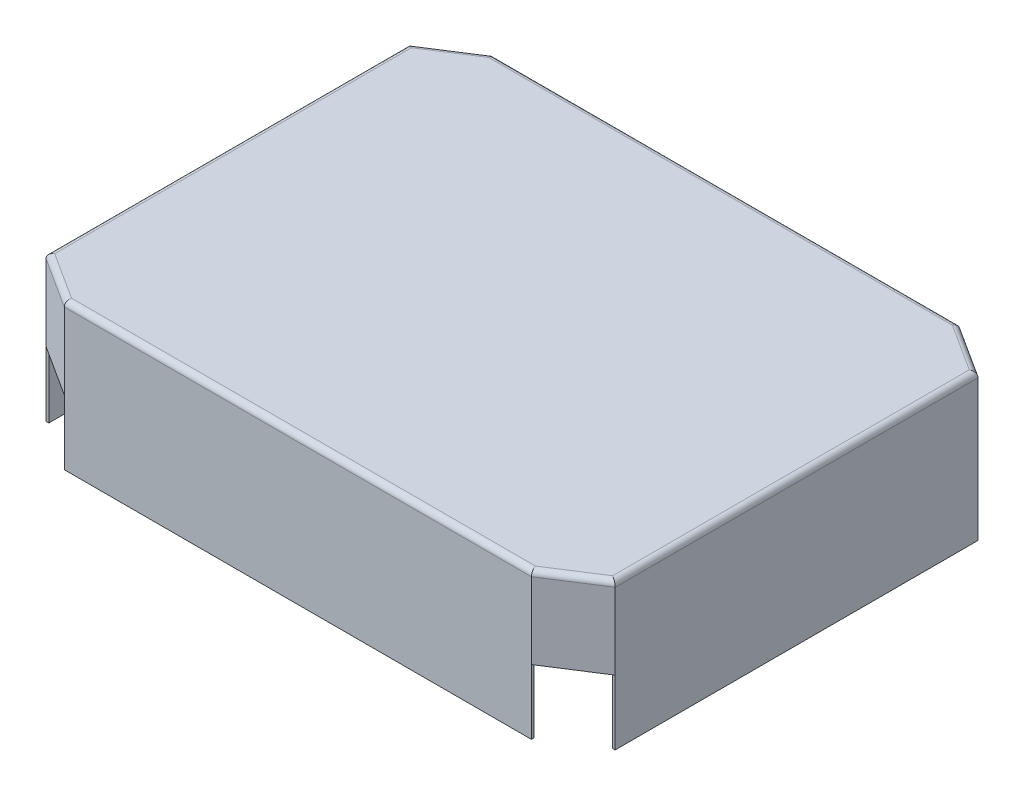
ISO-10303-21;
HEADER;
FILE_DESCRIPTION(('STEP AP214'),'2;1');
FILE_NAME('part.step','',(''),(''),'','','');
FILE_SCHEMA(('AUTOMOTIVE_DESIGN { 1 0 10303 214 1 1 1 1 }'));
ENDSEC;
DATA;
#1=APPLICATION_CONTEXT('core data for automotive mechanical design processes');
#2=APPLICATION_PROTOCOL_DEFINITION('international standard','automotive_design',2000,#1);
#3=PRODUCT_CONTEXT('',#1,'mechanical');
#4=PRODUCT('Part','Part','',(#3));
#5=PRODUCT_RELATED_PRODUCT_CATEGORY('part','',(#4));
#6=PRODUCT_DEFINITION_FORMATION('','',#4);
#7=PRODUCT_DEFINITION_CONTEXT('part definition',#1,'design');
#8=PRODUCT_DEFINITION('design','',#6,#7);
#9=PRODUCT_DEFINITION_SHAPE('','',#8);
#10=(LENGTH_UNIT() NAMED_UNIT(*) SI_UNIT(.MILLI.,.METRE.));
#11=(NAMED_UNIT(*) PLANE_ANGLE_UNIT() SI_UNIT($,.RADIAN.));
#12=(NAMED_UNIT(*) SI_UNIT($,.STERADIAN.) SOLID_ANGLE_UNIT());
#13=UNCERTAINTY_MEASURE_WITH_UNIT(LENGTH_MEASURE(1.E-05),#10,'distance_accuracy_value','');
#14=(GEOMETRIC_REPRESENTATION_CONTEXT(3) GLOBAL_UNCERTAINTY_ASSIGNED_CONTEXT((#13)) GLOBAL_UNIT_ASSIGNED_CONTEXT((#10,
#11,#12)) REPRESENTATION_CONTEXT('',''));
#15=CARTESIAN_POINT('',(0.,0.,0.));
#16=DIRECTION('',(0.,0.,1.));
#17=DIRECTION('',(1.,0.,0.));
#18=AXIS2_PLACEMENT_3D('',#15,#16,#17);
#19=CARTESIAN_POINT('',(0.,29.21,0.));
#20=DIRECTION('',(0.,-1.,0.));
#21=DIRECTION('',(0.,0.,-1.));
#22=AXIS2_PLACEMENT_3D('',#19,#20,#21);
#23=PLANE('',#22);
#24=DIRECTION('',(0.84985072279373,0.,-0.527023480470248));
#25=VECTOR('',#24,1.);
#26=CARTESIAN_POINT('',(127.,29.21,81.7796180000001));
#27=LINE('',#26,#25);
#28=CARTESIAN_POINT('',(105.278360825986,29.21,95.25));
#29=VERTEX_POINT('',#28);
#30=CARTESIAN_POINT('',(127.,29.21,81.7796180000001));
#31=VERTEX_POINT('',#30);
#32=EDGE_CURVE('E249',#29,#31,#27,.T.);
#33=ORIENTED_EDGE('',*,*,#32,.T.);
#34=DIRECTION('',(1.,0.,0.));
#35=VECTOR('',#34,1.);
#36=CARTESIAN_POINT('',(0.,29.21,81.7796180000001));
#37=LINE('',#36,#35);
#38=CARTESIAN_POINT('',(128.27,29.21,81.7796180000001));
#39=VERTEX_POINT('',#38);
#40=EDGE_CURVE('E393',#31,#39,#37,.T.);
#41=ORIENTED_EDGE('',*,*,#40,.T.);
#42=DIRECTION('',(0.841843341472549,0.,-0.539721954730705));
#43=VECTOR('',#42,1.);
#44=CARTESIAN_POINT('',(128.27,29.21,81.7796180000001));
#45=LINE('',#44,#43);
#46=CARTESIAN_POINT('',(105.278360825986,29.21,96.52));
#47=VERTEX_POINT('',#46);
#48=EDGE_CURVE('E274',#47,#39,#45,.T.);
#49=ORIENTED_EDGE('',*,*,#48,.F.);
#50=DIRECTION('',(0.,0.,1.));
#51=VECTOR('',#50,1.);
#52=CARTESIAN_POINT('',(105.278360825986,29.21,0.));
#53=LINE('',#52,#51);
#54=EDGE_CURVE('E303',#29,#47,#53,.T.);
#55=ORIENTED_EDGE('',*,*,#54,.F.);
#56=EDGE_LOOP('',(#33,#41,#49,#55));
#57=FACE_BOUND('',#56,.T.);
#58=ADVANCED_FACE('F32',(#57),#23,.T.);
#59=DIRECTION('',(1.,0.,0.));
#60=VECTOR('',#59,1.);
#61=CARTESIAN_POINT('',(-1.78727588284739E-12,29.21,-81.7796179999973));
#62=LINE('',#61,#60);
#63=CARTESIAN_POINT('',(127.,29.21,-81.7796180000001));
#64=VERTEX_POINT('',#63);
#65=CARTESIAN_POINT('',(128.27,29.21,-81.7796180000001));
#66=VERTEX_POINT('',#65);
#67=EDGE_CURVE('E401',#64,#66,#62,.T.);
#68=ORIENTED_EDGE('',*,*,#67,.F.);
#69=DIRECTION('',(-0.84985072279373,0.,-0.527023480470248));
#70=VECTOR('',#69,1.);
#71=CARTESIAN_POINT('',(105.278360825986,29.21,-95.25));
#72=LINE('',#71,#70);
#73=CARTESIAN_POINT('',(105.278360825986,29.21,-95.25));
#74=VERTEX_POINT('',#73);
#75=EDGE_CURVE('E253',#64,#74,#72,.T.);
#76=ORIENTED_EDGE('',*,*,#75,.T.);
#77=DIRECTION('',(0.,0.,-1.));
#78=VECTOR('',#77,1.);
#79=CARTESIAN_POINT('',(105.278360825986,29.21,0.));
#80=LINE('',#79,#78);
#81=CARTESIAN_POINT('',(105.278360825986,29.21,-96.52));
#82=VERTEX_POINT('',#81);
#83=EDGE_CURVE('E411',#74,#82,#80,.T.);
#84=ORIENTED_EDGE('',*,*,#83,.T.);
#85=DIRECTION('',(-0.841843341472549,0.,-0.539721954730705));
#86=VECTOR('',#85,1.);
#87=CARTESIAN_POINT('',(105.278360825986,29.21,-96.52));
#88=LINE('',#87,#86);
#89=EDGE_CURVE('E277',#66,#82,#88,.T.);
#90=ORIENTED_EDGE('',*,*,#89,.F.);
#91=EDGE_LOOP('',(#68,#76,#84,#90));
#92=FACE_BOUND('',#91,.T.);
#93=ADVANCED_FACE('F483',(#92),#23,.T.);
#94=DIRECTION('',(0.,0.,-1.));
#95=VECTOR('',#94,1.);
#96=CARTESIAN_POINT('',(-105.278360825986,29.21,0.));
#97=LINE('',#96,#95);
#98=CARTESIAN_POINT('',(-105.278360825986,29.21,-95.25));
#99=VERTEX_POINT('',#98);
#100=CARTESIAN_POINT('',(-105.278360825986,29.21,-96.52));
#101=VERTEX_POINT('',#100);
#102=EDGE_CURVE('E414',#99,#101,#97,.T.);
#103=ORIENTED_EDGE('',*,*,#102,.F.);
#104=DIRECTION('',(-0.84985072279373,0.,0.527023480470249));
#105=VECTOR('',#104,1.);
#106=CARTESIAN_POINT('',(-127.,29.21,-81.7796180000001));
#107=LINE('',#106,#105);
#108=CARTESIAN_POINT('',(-127.,29.21,-81.779618));
#109=VERTEX_POINT('',#108);
#110=EDGE_CURVE('E232',#99,#109,#107,.T.);
#111=ORIENTED_EDGE('',*,*,#110,.T.);
#112=DIRECTION('',(-1.,0.,0.));
#113=VECTOR('',#112,1.);
#114=CARTESIAN_POINT('',(0.,29.21,-81.7796180000001));
#115=LINE('',#114,#113);
#116=CARTESIAN_POINT('',(-128.27,29.21,-81.7796180000001));
#117=VERTEX_POINT('',#116);
#118=EDGE_CURVE('E438',#109,#117,#115,.T.);
#119=ORIENTED_EDGE('',*,*,#118,.T.);
#120=DIRECTION('',(-0.841843341472549,0.,0.539721954730706));
#121=VECTOR('',#120,1.);
#122=CARTESIAN_POINT('',(-128.27,29.21,-81.7796180000001));
#123=LINE('',#122,#121);
#124=EDGE_CURVE('E280',#101,#117,#123,.T.);
#125=ORIENTED_EDGE('',*,*,#124,.F.);
#126=EDGE_LOOP('',(#103,#111,#119,#125));
#127=FACE_BOUND('',#126,.T.);
#128=ADVANCED_FACE('F577',(#127),#23,.T.);
#129=CARTESIAN_POINT('',(0.,29.21,95.25));
#130=DIRECTION('',(0.,0.,-1.));
#131=DIRECTION('',(-1.,0.,0.));
#132=AXIS2_PLACEMENT_3D('',#129,#130,#131);
#133=PLANE('',#132);
#134=DIRECTION('',(1.,0.,0.));
#135=VECTOR('',#134,1.);
#136=CARTESIAN_POINT('',(0.,0.,95.25));
#137=LINE('',#136,#135);
#138=CARTESIAN_POINT('',(-105.278360825986,0.,95.25));
#139=VERTEX_POINT('',#138);
#140=CARTESIAN_POINT('',(105.278360825986,0.,95.25));
#141=VERTEX_POINT('',#140);
#142=EDGE_CURVE('E299',#139,#141,#137,.T.);
#143=ORIENTED_EDGE('',*,*,#142,.F.);
#144=DIRECTION('',(0.,-1.,0.));
#145=VECTOR('',#144,1.);
#146=CARTESIAN_POINT('',(-105.278360825986,29.21,95.25));
#147=LINE('',#146,#145);
#148=CARTESIAN_POINT('',(-105.278360825986,29.21,95.25));
#149=VERTEX_POINT('',#148);
#150=EDGE_CURVE('E323',#149,#139,#147,.T.);
#151=ORIENTED_EDGE('',*,*,#150,.F.);
#152=DIRECTION('',(0.,-1.,0.));
#153=VECTOR('',#152,1.);
#154=CARTESIAN_POINT('',(-105.278360825986,64.77,95.25));
#155=LINE('',#154,#153);
#156=CARTESIAN_POINT('',(-105.278360825986,64.77,95.25));
#157=VERTEX_POINT('',#156);
#158=EDGE_CURVE('E267',#157,#149,#155,.T.);
#159=ORIENTED_EDGE('',*,*,#158,.F.);
#160=DIRECTION('',(1.,0.,0.));
#161=VECTOR('',#160,1.);
#162=CARTESIAN_POINT('',(105.278360825986,64.77,95.25));
#163=LINE('',#162,#161);
#164=CARTESIAN_POINT('',(105.278360825986,64.77,95.25));
#165=VERTEX_POINT('',#164);
#166=EDGE_CURVE('E467',#157,#165,#163,.T.);
#167=ORIENTED_EDGE('',*,*,#166,.T.);
#168=DIRECTION('',(0.,-1.,0.));
#169=VECTOR('',#168,1.);
#170=CARTESIAN_POINT('',(105.278360825986,64.77,95.25));
#171=LINE('',#170,#169);
#172=EDGE_CURVE('E264',#165,#29,#171,.T.);
#173=ORIENTED_EDGE('',*,*,#172,.T.);
#174=DIRECTION('',(0.,-1.,0.));
#175=VECTOR('',#174,1.);
#176=CARTESIAN_POINT('',(105.278360825986,29.21,95.25));
#177=LINE('',#176,#175);
#178=EDGE_CURVE('E307',#29,#141,#177,.T.);
#179=ORIENTED_EDGE('',*,*,#178,.T.);
#180=EDGE_LOOP('',(#143,#151,#159,#167,#173,#179));
#181=FACE_BOUND('',#180,.T.);
#182=ADVANCED_FACE('F541',(#181),#133,.T.);
#183=CARTESIAN_POINT('',(-105.278360825986,29.21,0.));
#184=DIRECTION('',(1.,0.,0.));
#185=DIRECTION('',(0.,0.,-1.));
#186=AXIS2_PLACEMENT_3D('',#183,#184,#185);
#187=PLANE('',#186);
#188=DIRECTION('',(0.,0.,1.));
#189=VECTOR('',#188,1.);
#190=CARTESIAN_POINT('',(-105.278360825986,0.,0.));
#191=LINE('',#190,#189);
#192=CARTESIAN_POINT('',(-105.278360825986,0.,96.52));
#193=VERTEX_POINT('',#192);
#194=EDGE_CURVE('E310',#139,#193,#191,.T.);
#195=ORIENTED_EDGE('',*,*,#194,.T.);
#196=DIRECTION('',(0.,-1.,0.));
#197=VECTOR('',#196,1.);
#198=CARTESIAN_POINT('',(-105.278360825986,29.21,96.52));
#199=LINE('',#198,#197);
#200=CARTESIAN_POINT('',(-105.278360825986,29.21,96.52));
#201=VERTEX_POINT('',#200);
#202=EDGE_CURVE('E321',#201,#193,#199,.T.);
#203=ORIENTED_EDGE('',*,*,#202,.F.);
#204=DIRECTION('',(0.,0.,1.));
#205=VECTOR('',#204,1.);
#206=CARTESIAN_POINT('',(-105.278360825986,29.21,0.));
#207=LINE('',#206,#205);
#208=EDGE_CURVE('E300',#149,#201,#207,.T.);
#209=ORIENTED_EDGE('',*,*,#208,.F.);
#210=ORIENTED_EDGE('',*,*,#150,.T.);
#211=EDGE_LOOP('',(#195,#203,#209,#210));
#212=FACE_BOUND('',#211,.T.);
#213=ADVANCED_FACE('F549',(#212),#187,.F.);
#214=CARTESIAN_POINT('',(0.,29.21,96.52));
#215=DIRECTION('',(0.,0.,1.));
#216=DIRECTION('',(1.,0.,0.));
#217=AXIS2_PLACEMENT_3D('',#214,#215,#216);
#218=PLANE('',#217);
#219=DIRECTION('',(0.,-1.,0.));
#220=VECTOR('',#219,1.);
#221=CARTESIAN_POINT('',(105.278360825986,64.77,96.52));
#222=LINE('',#221,#220);
#223=CARTESIAN_POINT('',(105.278360825986,63.5,96.52));
#224=VERTEX_POINT('',#223);
#225=EDGE_CURVE('E293',#224,#47,#222,.T.);
#226=ORIENTED_EDGE('',*,*,#225,.F.);
#227=DIRECTION('',(1.,0.,0.));
#228=VECTOR('',#227,1.);
#229=CARTESIAN_POINT('',(-105.278360825986,63.5,96.52));
#230=LINE('',#229,#228);
#231=CARTESIAN_POINT('',(-105.278360825986,63.5,96.52));
#232=VERTEX_POINT('',#231);
#233=EDGE_CURVE('E345',#224,#232,#230,.F.);
#234=ORIENTED_EDGE('',*,*,#233,.T.);
#235=DIRECTION('',(0.,-1.,0.));
#236=VECTOR('',#235,1.);
#237=CARTESIAN_POINT('',(-105.278360825986,64.77,96.52));
#238=LINE('',#237,#236);
#239=EDGE_CURVE('E295',#232,#201,#238,.T.);
#240=ORIENTED_EDGE('',*,*,#239,.T.);
#241=ORIENTED_EDGE('',*,*,#202,.T.);
#242=DIRECTION('',(-1.,0.,0.));
#243=VECTOR('',#242,1.);
#244=CARTESIAN_POINT('',(0.,0.,96.52));
#245=LINE('',#244,#243);
#246=CARTESIAN_POINT('',(105.278360825986,0.,96.52));
#247=VERTEX_POINT('',#246);
#248=EDGE_CURVE('E313',#247,#193,#245,.T.);
#249=ORIENTED_EDGE('',*,*,#248,.F.);
#250=DIRECTION('',(0.,-1.,0.));
#251=VECTOR('',#250,1.);
#252=CARTESIAN_POINT('',(105.278360825986,29.21,96.52));
#253=LINE('',#252,#251);
#254=EDGE_CURVE('E319',#47,#247,#253,.T.);
#255=ORIENTED_EDGE('',*,*,#254,.F.);
#256=EDGE_LOOP('',(#226,#234,#240,#241,#249,#255));
#257=FACE_BOUND('',#256,.T.);
#258=ADVANCED_FACE('F601',(#257),#218,.T.);
#259=CARTESIAN_POINT('',(105.278360825986,29.21,0.));
#260=DIRECTION('',(1.,0.,0.));
#261=DIRECTION('',(0.,0.,-1.));
#262=AXIS2_PLACEMENT_3D('',#259,#260,#261);
#263=PLANE('',#262);
#264=DIRECTION('',(0.,0.,1.));
#265=VECTOR('',#264,1.);
#266=CARTESIAN_POINT('',(105.278360825986,0.,0.));
#267=LINE('',#266,#265);
#268=EDGE_CURVE('E304',#141,#247,#267,.T.);
#269=ORIENTED_EDGE('',*,*,#268,.F.);
#270=ORIENTED_EDGE('',*,*,#178,.F.);
#271=ORIENTED_EDGE('',*,*,#54,.T.);
#272=ORIENTED_EDGE('',*,*,#254,.T.);
#273=EDGE_LOOP('',(#269,#270,#271,#272));
#274=FACE_BOUND('',#273,.T.);
#275=ADVANCED_FACE('F538',(#274),#263,.T.);
#276=CARTESIAN_POINT('',(0.,0.,0.));
#277=DIRECTION('',(0.,1.,0.));
#278=DIRECTION('',(0.,0.,1.));
#279=AXIS2_PLACEMENT_3D('',#276,#277,#278);
#280=PLANE('',#279);
#281=ORIENTED_EDGE('',*,*,#142,.T.);
#282=ORIENTED_EDGE('',*,*,#268,.T.);
#283=ORIENTED_EDGE('',*,*,#248,.T.);
#284=ORIENTED_EDGE('',*,*,#194,.F.);
#285=EDGE_LOOP('',(#281,#282,#283,#284));
#286=FACE_BOUND('',#285,.T.);
#287=ADVANCED_FACE('F545',(#286),#280,.F.);
#288=DIRECTION('',(-1.,0.,0.));
#289=VECTOR('',#288,1.);
#290=CARTESIAN_POINT('',(1.78727588284743E-12,29.21,81.7796179999973));
#291=LINE('',#290,#289);
#292=CARTESIAN_POINT('',(-127.,29.21,81.7796180000001));
#293=VERTEX_POINT('',#292);
#294=CARTESIAN_POINT('',(-128.27,29.21,81.7796180000001));
#295=VERTEX_POINT('',#294);
#296=EDGE_CURVE('E441',#293,#295,#291,.T.);
#297=ORIENTED_EDGE('',*,*,#296,.F.);
#298=DIRECTION('',(0.84985072279373,0.,0.527023480470249));
#299=VECTOR('',#298,1.);
#300=CARTESIAN_POINT('',(-105.278360825986,29.21,95.25));
#301=LINE('',#300,#299);
#302=EDGE_CURVE('E246',#293,#149,#301,.T.);
#303=ORIENTED_EDGE('',*,*,#302,.T.);
#304=ORIENTED_EDGE('',*,*,#208,.T.);
#305=DIRECTION('',(0.841843341472549,0.,0.539721954730705));
#306=VECTOR('',#305,1.);
#307=CARTESIAN_POINT('',(-105.278360825986,29.21,96.52));
#308=LINE('',#307,#306);
#309=EDGE_CURVE('E271',#295,#201,#308,.T.);
#310=ORIENTED_EDGE('',*,*,#309,.F.);
#311=EDGE_LOOP('',(#297,#303,#304,#310));
#312=FACE_BOUND('',#311,.T.);
#313=ADVANCED_FACE('F558',(#312),#23,.T.);
#314=CARTESIAN_POINT('',(-128.27,64.77,81.7796180000001));
#315=DIRECTION('',(1.,0.,0.));
#316=DIRECTION('',(0.,0.,-1.));
#317=AXIS2_PLACEMENT_3D('',#314,#315,#316);
#318=PLANE('',#317);
#319=DIRECTION('',(0.,-1.,0.));
#320=VECTOR('',#319,1.);
#321=CARTESIAN_POINT('',(-128.27,64.77,81.7796180000001));
#322=LINE('',#321,#320);
#323=CARTESIAN_POINT('',(-128.27,63.5,81.7796180000001));
#324=VERTEX_POINT('',#323);
#325=EDGE_CURVE('E297',#324,#295,#322,.T.);
#326=ORIENTED_EDGE('',*,*,#325,.F.);
#327=DIRECTION('',(0.,0.,1.));
#328=VECTOR('',#327,1.);
#329=CARTESIAN_POINT('',(-128.27,63.5,81.7796180000001));
#330=LINE('',#329,#328);
#331=CARTESIAN_POINT('',(-128.27,63.5,-81.7796180000001));
#332=VERTEX_POINT('',#331);
#333=EDGE_CURVE('E41',#324,#332,#330,.F.);
#334=ORIENTED_EDGE('',*,*,#333,.T.);
#335=DIRECTION('',(0.,-1.,0.));
#336=VECTOR('',#335,1.);
#337=CARTESIAN_POINT('',(-128.27,64.77,-81.7796180000001));
#338=LINE('',#337,#336);
#339=EDGE_CURVE('E283',#332,#117,#338,.T.);
#340=ORIENTED_EDGE('',*,*,#339,.T.);
#341=DIRECTION('',(0.,-1.,0.));
#342=VECTOR('',#341,1.);
#343=CARTESIAN_POINT('',(-128.27,29.21,-81.7796180000001));
#344=LINE('',#343,#342);
#345=CARTESIAN_POINT('',(-128.27,0.,-81.7796180000001));
#346=VERTEX_POINT('',#345);
#347=EDGE_CURVE('E250',#117,#346,#344,.T.);
#348=ORIENTED_EDGE('',*,*,#347,.T.);
#349=DIRECTION('',(0.,0.,1.));
#350=VECTOR('',#349,1.);
#351=CARTESIAN_POINT('',(-128.27,0.,0.));
#352=LINE('',#351,#350);
#353=CARTESIAN_POINT('',(-128.27,0.,81.7796180000001));
#354=VERTEX_POINT('',#353);
#355=EDGE_CURVE('E448',#346,#354,#352,.T.);
#356=ORIENTED_EDGE('',*,*,#355,.T.);
#357=DIRECTION('',(0.,-1.,0.));
#358=VECTOR('',#357,1.);
#359=CARTESIAN_POINT('',(-128.27,29.21,81.7796180000001));
#360=LINE('',#359,#358);
#361=EDGE_CURVE('E459',#295,#354,#360,.T.);
#362=ORIENTED_EDGE('',*,*,#361,.F.);
#363=EDGE_LOOP('',(#326,#334,#340,#348,#356,#362));
#364=FACE_BOUND('',#363,.T.);
#365=ADVANCED_FACE('F626',(#364),#318,.F.);
#366=CARTESIAN_POINT('',(-105.278360825986,64.77,96.52));
#367=DIRECTION('',(0.539721954730705,0.,-0.841843341472549));
#368=DIRECTION('',(-0.841843341472549,0.,-0.539721954730705));
#369=AXIS2_PLACEMENT_3D('',#366,#367,#368);
#370=PLANE('',#369);
#371=ORIENTED_EDGE('',*,*,#239,.F.);
#372=DIRECTION('',(0.841843341472549,0.,0.539721954730705));
#373=VECTOR('',#372,1.);
#374=CARTESIAN_POINT('',(-105.278360825986,63.5,96.52));
#375=LINE('',#374,#373);
#376=EDGE_CURVE('E342',#232,#324,#375,.F.);
#377=ORIENTED_EDGE('',*,*,#376,.T.);
#378=ORIENTED_EDGE('',*,*,#325,.T.);
#379=ORIENTED_EDGE('',*,*,#309,.T.);
#380=EDGE_LOOP('',(#371,#377,#378,#379));
#381=FACE_BOUND('',#380,.T.);
#382=ADVANCED_FACE('F604',(#381),#370,.F.);
#383=CARTESIAN_POINT('',(128.27,64.77,81.7796180000001));
#384=DIRECTION('',(-0.539721954730705,0.,-0.841843341472549));
#385=DIRECTION('',(-0.841843341472549,0.,0.539721954730705));
#386=AXIS2_PLACEMENT_3D('',#383,#384,#385);
#387=PLANE('',#386);
#388=DIRECTION('',(0.,-1.,0.));
#389=VECTOR('',#388,1.);
#390=CARTESIAN_POINT('',(128.27,64.77,81.7796180000001));
#391=LINE('',#390,#389);
#392=CARTESIAN_POINT('',(128.27,63.5,81.7796180000001));
#393=VERTEX_POINT('',#392);
#394=EDGE_CURVE('E291',#393,#39,#391,.T.);
#395=ORIENTED_EDGE('',*,*,#394,.F.);
#396=DIRECTION('',(0.841843341472549,0.,-0.539721954730705));
#397=VECTOR('',#396,1.);
#398=CARTESIAN_POINT('',(128.27,63.5,81.7796180000001));
#399=LINE('',#398,#397);
#400=EDGE_CURVE('E347',#393,#224,#399,.F.);
#401=ORIENTED_EDGE('',*,*,#400,.T.);
#402=ORIENTED_EDGE('',*,*,#225,.T.);
#403=ORIENTED_EDGE('',*,*,#48,.T.);
#404=EDGE_LOOP('',(#395,#401,#402,#403));
#405=FACE_BOUND('',#404,.T.);
#406=ADVANCED_FACE('F517',(#405),#387,.F.);
#407=CARTESIAN_POINT('',(128.27,64.77,-81.7796180000001));
#408=DIRECTION('',(-1.,0.,0.));
#409=DIRECTION('',(0.,0.,1.));
#410=AXIS2_PLACEMENT_3D('',#407,#408,#409);
#411=PLANE('',#410);
#412=DIRECTION('',(0.,-1.,0.));
#413=VECTOR('',#412,1.);
#414=CARTESIAN_POINT('',(128.27,64.77,-81.7796180000001));
#415=LINE('',#414,#413);
#416=CARTESIAN_POINT('',(128.27,63.5,-81.7796180000001));
#417=VERTEX_POINT('',#416);
#418=EDGE_CURVE('E289',#417,#66,#415,.T.);
#419=ORIENTED_EDGE('',*,*,#418,.F.);
#420=DIRECTION('',(0.,0.,-1.));
#421=VECTOR('',#420,1.);
#422=CARTESIAN_POINT('',(128.27,63.5,-81.7796180000001));
#423=LINE('',#422,#421);
#424=EDGE_CURVE('E349',#417,#393,#423,.F.);
#425=ORIENTED_EDGE('',*,*,#424,.T.);
#426=ORIENTED_EDGE('',*,*,#394,.T.);
#427=DIRECTION('',(0.,-1.,0.));
#428=VECTOR('',#427,1.);
#429=CARTESIAN_POINT('',(128.27,29.21,81.7796180000001));
#430=LINE('',#429,#428);
#431=CARTESIAN_POINT('',(128.27,0.,81.7796180000001));
#432=VERTEX_POINT('',#431);
#433=EDGE_CURVE('E402',#39,#432,#430,.T.);
#434=ORIENTED_EDGE('',*,*,#433,.T.);
#435=DIRECTION('',(0.,0.,1.));
#436=VECTOR('',#435,1.);
#437=CARTESIAN_POINT('',(128.27,0.,0.));
#438=LINE('',#437,#436);
#439=CARTESIAN_POINT('',(128.27,0.,-81.7796180000001));
#440=VERTEX_POINT('',#439);
#441=EDGE_CURVE('E378',#440,#432,#438,.T.);
#442=ORIENTED_EDGE('',*,*,#441,.F.);
#443=DIRECTION('',(0.,-1.,0.));
#444=VECTOR('',#443,1.);
#445=CARTESIAN_POINT('',(128.27,29.21,-81.7796180000001));
#446=LINE('',#445,#444);
#447=EDGE_CURVE('E408',#66,#440,#446,.T.);
#448=ORIENTED_EDGE('',*,*,#447,.F.);
#449=EDGE_LOOP('',(#419,#425,#426,#434,#442,#448));
#450=FACE_BOUND('',#449,.T.);
#451=ADVANCED_FACE('F513',(#450),#411,.F.);
#452=CARTESIAN_POINT('',(105.278360825986,64.77,-96.52));
#453=DIRECTION('',(-0.539721954730705,0.,0.841843341472549));
#454=DIRECTION('',(0.841843341472549,0.,0.539721954730705));
#455=AXIS2_PLACEMENT_3D('',#452,#453,#454);
#456=PLANE('',#455);
#457=DIRECTION('',(0.,-1.,0.));
#458=VECTOR('',#457,1.);
#459=CARTESIAN_POINT('',(105.278360825986,64.77,-96.52));
#460=LINE('',#459,#458);
#461=CARTESIAN_POINT('',(105.278360825986,63.5,-96.52));
#462=VERTEX_POINT('',#461);
#463=EDGE_CURVE('E287',#462,#82,#460,.T.);
#464=ORIENTED_EDGE('',*,*,#463,.F.);
#465=DIRECTION('',(-0.841843341472549,0.,-0.539721954730705));
#466=VECTOR('',#465,1.);
#467=CARTESIAN_POINT('',(105.278360825986,63.5,-96.52));
#468=LINE('',#467,#466);
#469=EDGE_CURVE('E351',#462,#417,#468,.F.);
#470=ORIENTED_EDGE('',*,*,#469,.T.);
#471=ORIENTED_EDGE('',*,*,#418,.T.);
#472=ORIENTED_EDGE('',*,*,#89,.T.);
#473=EDGE_LOOP('',(#464,#470,#471,#472));
#474=FACE_BOUND('',#473,.T.);
#475=ADVANCED_FACE('F504',(#474),#456,.F.);
#476=CARTESIAN_POINT('',(-105.278360825986,64.77,-96.52));
#477=DIRECTION('',(0.,0.,1.));
#478=DIRECTION('',(1.,0.,0.));
#479=AXIS2_PLACEMENT_3D('',#476,#477,#478);
#480=PLANE('',#479);
#481=DIRECTION('',(0.,-1.,0.));
#482=VECTOR('',#481,1.);
#483=CARTESIAN_POINT('',(-105.278360825986,64.77,-96.52));
#484=LINE('',#483,#482);
#485=CARTESIAN_POINT('',(-105.278360825986,63.5,-96.52));
#486=VERTEX_POINT('',#485);
#487=EDGE_CURVE('E285',#486,#101,#484,.T.);
#488=ORIENTED_EDGE('',*,*,#487,.F.);
#489=DIRECTION('',(-1.,0.,0.));
#490=VECTOR('',#489,1.);
#491=CARTESIAN_POINT('',(-105.278360825986,63.5,-96.52));
#492=LINE('',#491,#490);
#493=EDGE_CURVE('E353',#486,#462,#492,.F.);
#494=ORIENTED_EDGE('',*,*,#493,.T.);
#495=ORIENTED_EDGE('',*,*,#463,.T.);
#496=DIRECTION('',(0.,-1.,0.));
#497=VECTOR('',#496,1.);
#498=CARTESIAN_POINT('',(105.278360825986,29.21,-96.52));
#499=LINE('',#498,#497);
#500=CARTESIAN_POINT('',(105.278360825986,0.,-96.52));
#501=VERTEX_POINT('',#500);
#502=EDGE_CURVE('E432',#82,#501,#499,.T.);
#503=ORIENTED_EDGE('',*,*,#502,.T.);
#504=DIRECTION('',(1.,0.,0.));
#505=VECTOR('',#504,1.);
#506=CARTESIAN_POINT('',(0.,0.,-96.52));
#507=LINE('',#506,#505);
#508=CARTESIAN_POINT('',(-105.278360825986,0.,-96.52));
#509=VERTEX_POINT('',#508);
#510=EDGE_CURVE('E424',#509,#501,#507,.T.);
#511=ORIENTED_EDGE('',*,*,#510,.F.);
#512=DIRECTION('',(0.,-1.,0.));
#513=VECTOR('',#512,1.);
#514=CARTESIAN_POINT('',(-105.278360825986,29.21,-96.52));
#515=LINE('',#514,#513);
#516=EDGE_CURVE('E430',#101,#509,#515,.T.);
#517=ORIENTED_EDGE('',*,*,#516,.F.);
#518=EDGE_LOOP('',(#488,#494,#495,#503,#511,#517));
#519=FACE_BOUND('',#518,.T.);
#520=ADVANCED_FACE('F500',(#519),#480,.F.);
#521=CARTESIAN_POINT('',(-128.27,64.77,-81.7796180000001));
#522=DIRECTION('',(0.539721954730706,0.,0.841843341472549));
#523=DIRECTION('',(0.841843341472549,0.,-0.539721954730706));
#524=AXIS2_PLACEMENT_3D('',#521,#522,#523);
#525=PLANE('',#524);
#526=ORIENTED_EDGE('',*,*,#339,.F.);
#527=DIRECTION('',(-0.841843341472549,0.,0.539721954730706));
#528=VECTOR('',#527,1.);
#529=CARTESIAN_POINT('',(-128.27,63.5,-81.7796180000001));
#530=LINE('',#529,#528);
#531=EDGE_CURVE('E11',#332,#486,#530,.F.);
#532=ORIENTED_EDGE('',*,*,#531,.T.);
#533=ORIENTED_EDGE('',*,*,#487,.T.);
#534=ORIENTED_EDGE('',*,*,#124,.T.);
#535=EDGE_LOOP('',(#526,#532,#533,#534));
#536=FACE_BOUND('',#535,.T.);
#537=ADVANCED_FACE('F579',(#536),#525,.F.);
#538=CARTESIAN_POINT('',(-127.,64.77,81.7796180000001));
#539=DIRECTION('',(1.,0.,0.));
#540=DIRECTION('',(0.,0.,-1.));
#541=AXIS2_PLACEMENT_3D('',#538,#539,#540);
#542=PLANE('',#541);
#543=DIRECTION('',(0.,-1.,0.));
#544=VECTOR('',#543,1.);
#545=CARTESIAN_POINT('',(-127.,64.77,81.7796180000001));
#546=LINE('',#545,#544);
#547=CARTESIAN_POINT('',(-127.,64.77,81.7796180000001));
#548=VERTEX_POINT('',#547);
#549=EDGE_CURVE('E269',#548,#293,#546,.T.);
#550=ORIENTED_EDGE('',*,*,#549,.T.);
#551=DIRECTION('',(0.,-1.,0.));
#552=VECTOR('',#551,1.);
#553=CARTESIAN_POINT('',(-127.,29.21,81.7796180000001));
#554=LINE('',#553,#552);
#555=CARTESIAN_POINT('',(-127.,0.,81.7796180000001));
#556=VERTEX_POINT('',#555);
#557=EDGE_CURVE('E457',#293,#556,#554,.T.);
#558=ORIENTED_EDGE('',*,*,#557,.T.);
#559=DIRECTION('',(0.,0.,-1.));
#560=VECTOR('',#559,1.);
#561=CARTESIAN_POINT('',(-127.,0.,0.));
#562=LINE('',#561,#560);
#563=CARTESIAN_POINT('',(-127.,0.,-81.7796180000001));
#564=VERTEX_POINT('',#563);
#565=EDGE_CURVE('E442',#556,#564,#562,.T.);
#566=ORIENTED_EDGE('',*,*,#565,.T.);
#567=DIRECTION('',(0.,-1.,0.));
#568=VECTOR('',#567,1.);
#569=CARTESIAN_POINT('',(-127.,29.21,-81.7796180000001));
#570=LINE('',#569,#568);
#571=EDGE_CURVE('E445',#109,#564,#570,.T.);
#572=ORIENTED_EDGE('',*,*,#571,.F.);
#573=DIRECTION('',(0.,-1.,0.));
#574=VECTOR('',#573,1.);
#575=CARTESIAN_POINT('',(-127.,64.77,-81.7796180000001));
#576=LINE('',#575,#574);
#577=CARTESIAN_POINT('',(-127.,64.77,-81.7796180000001));
#578=VERTEX_POINT('',#577);
#579=EDGE_CURVE('E226',#578,#109,#576,.T.);
#580=ORIENTED_EDGE('',*,*,#579,.F.);
#581=DIRECTION('',(0.,0.,1.));
#582=VECTOR('',#581,1.);
#583=CARTESIAN_POINT('',(-127.,64.77,81.7796180000001));
#584=LINE('',#583,#582);
#585=EDGE_CURVE('E223',#578,#548,#584,.T.);
#586=ORIENTED_EDGE('',*,*,#585,.T.);
#587=EDGE_LOOP('',(#550,#558,#566,#572,#580,#586));
#588=FACE_BOUND('',#587,.T.);
#589=ADVANCED_FACE('F567',(#588),#542,.T.);
#590=CARTESIAN_POINT('',(-105.278360825986,64.77,95.25));
#591=DIRECTION('',(0.527023480470249,0.,-0.84985072279373));
#592=DIRECTION('',(-0.84985072279373,0.,-0.527023480470249));
#593=AXIS2_PLACEMENT_3D('',#590,#591,#592);
#594=PLANE('',#593);
#595=ORIENTED_EDGE('',*,*,#302,.F.);
#596=ORIENTED_EDGE('',*,*,#549,.F.);
#597=DIRECTION('',(0.84985072279373,0.,0.527023480470249));
#598=VECTOR('',#597,1.);
#599=CARTESIAN_POINT('',(-105.278360825986,64.77,95.25));
#600=LINE('',#599,#598);
#601=EDGE_CURVE('E464',#548,#157,#600,.T.);
#602=ORIENTED_EDGE('',*,*,#601,.T.);
#603=ORIENTED_EDGE('',*,*,#158,.T.);
#604=EDGE_LOOP('',(#595,#596,#602,#603));
#605=FACE_BOUND('',#604,.T.);
#606=ADVANCED_FACE('F554',(#605),#594,.T.);
#607=CARTESIAN_POINT('',(127.,64.77,81.7796180000001));
#608=DIRECTION('',(-0.527023480470248,0.,-0.849850722793731));
#609=DIRECTION('',(-0.84985072279373,0.,0.527023480470248));
#610=AXIS2_PLACEMENT_3D('',#607,#608,#609);
#611=PLANE('',#610);
#612=ORIENTED_EDGE('',*,*,#32,.F.);
#613=ORIENTED_EDGE('',*,*,#172,.F.);
#614=DIRECTION('',(0.84985072279373,0.,-0.527023480470248));
#615=VECTOR('',#614,1.);
#616=CARTESIAN_POINT('',(127.,64.77,81.7796180000001));
#617=LINE('',#616,#615);
#618=CARTESIAN_POINT('',(127.,64.77,81.7796180000001));
#619=VERTEX_POINT('',#618);
#620=EDGE_CURVE('E470',#165,#619,#617,.T.);
#621=ORIENTED_EDGE('',*,*,#620,.T.);
#622=DIRECTION('',(0.,-1.,0.));
#623=VECTOR('',#622,1.);
#624=CARTESIAN_POINT('',(127.,64.77,81.7796180000001));
#625=LINE('',#624,#623);
#626=EDGE_CURVE('E262',#619,#31,#625,.T.);
#627=ORIENTED_EDGE('',*,*,#626,.T.);
#628=EDGE_LOOP('',(#612,#613,#621,#627));
#629=FACE_BOUND('',#628,.T.);
#630=ADVANCED_FACE('F535',(#629),#611,.T.);
#631=CARTESIAN_POINT('',(127.,64.77,-81.7796180000001));
#632=DIRECTION('',(-1.,0.,0.));
#633=DIRECTION('',(0.,0.,1.));
#634=AXIS2_PLACEMENT_3D('',#631,#632,#633);
#635=PLANE('',#634);
#636=DIRECTION('',(0.,-1.,0.));
#637=VECTOR('',#636,1.);
#638=CARTESIAN_POINT('',(127.,64.77,-81.7796180000001));
#639=LINE('',#638,#637);
#640=CARTESIAN_POINT('',(127.,64.77,-81.7796180000001));
#641=VERTEX_POINT('',#640);
#642=EDGE_CURVE('E259',#641,#64,#639,.T.);
#643=ORIENTED_EDGE('',*,*,#642,.T.);
#644=DIRECTION('',(0.,-1.,0.));
#645=VECTOR('',#644,1.);
#646=CARTESIAN_POINT('',(127.,29.21,-81.7796180000001));
#647=LINE('',#646,#645);
#648=CARTESIAN_POINT('',(127.,0.,-81.7796180000001));
#649=VERTEX_POINT('',#648);
#650=EDGE_CURVE('E406',#64,#649,#647,.T.);
#651=ORIENTED_EDGE('',*,*,#650,.T.);
#652=DIRECTION('',(0.,0.,-1.));
#653=VECTOR('',#652,1.);
#654=CARTESIAN_POINT('',(127.,0.,0.));
#655=LINE('',#654,#653);
#656=CARTESIAN_POINT('',(127.,0.,81.7796180000001));
#657=VERTEX_POINT('',#656);
#658=EDGE_CURVE('E390',#657,#649,#655,.T.);
#659=ORIENTED_EDGE('',*,*,#658,.F.);
#660=DIRECTION('',(0.,-1.,0.));
#661=VECTOR('',#660,1.);
#662=CARTESIAN_POINT('',(127.,29.21,81.7796180000001));
#663=LINE('',#662,#661);
#664=EDGE_CURVE('E404',#31,#657,#663,.T.);
#665=ORIENTED_EDGE('',*,*,#664,.F.);
#666=ORIENTED_EDGE('',*,*,#626,.F.);
#667=DIRECTION('',(0.,0.,-1.));
#668=VECTOR('',#667,1.);
#669=CARTESIAN_POINT('',(127.,64.77,-81.7796180000001));
#670=LINE('',#669,#668);
#671=EDGE_CURVE('E242',#619,#641,#670,.T.);
#672=ORIENTED_EDGE('',*,*,#671,.T.);
#673=EDGE_LOOP('',(#643,#651,#659,#665,#666,#672));
#674=FACE_BOUND('',#673,.T.);
#675=ADVANCED_FACE('F476',(#674),#635,.T.);
#676=CARTESIAN_POINT('',(105.278360825986,64.77,-95.25));
#677=DIRECTION('',(-0.527023480470248,0.,0.849850722793731));
#678=DIRECTION('',(0.84985072279373,0.,0.527023480470248));
#679=AXIS2_PLACEMENT_3D('',#676,#677,#678);
#680=PLANE('',#679);
#681=ORIENTED_EDGE('',*,*,#75,.F.);
#682=ORIENTED_EDGE('',*,*,#642,.F.);
#683=DIRECTION('',(-0.84985072279373,0.,-0.527023480470248));
#684=VECTOR('',#683,1.);
#685=CARTESIAN_POINT('',(105.278360825986,64.77,-95.25));
#686=LINE('',#685,#684);
#687=CARTESIAN_POINT('',(105.278360825986,64.77,-95.25));
#688=VERTEX_POINT('',#687);
#689=EDGE_CURVE('E240',#641,#688,#686,.T.);
#690=ORIENTED_EDGE('',*,*,#689,.T.);
#691=DIRECTION('',(0.,-1.,0.));
#692=VECTOR('',#691,1.);
#693=CARTESIAN_POINT('',(105.278360825986,64.77,-95.25));
#694=LINE('',#693,#692);
#695=EDGE_CURVE('E235',#688,#74,#694,.T.);
#696=ORIENTED_EDGE('',*,*,#695,.T.);
#697=EDGE_LOOP('',(#681,#682,#690,#696));
#698=FACE_BOUND('',#697,.T.);
#699=ADVANCED_FACE('F480',(#698),#680,.T.);
#700=CARTESIAN_POINT('',(-105.278360825986,64.77,-95.25));
#701=DIRECTION('',(0.,0.,1.));
#702=DIRECTION('',(1.,0.,0.));
#703=AXIS2_PLACEMENT_3D('',#700,#701,#702);
#704=PLANE('',#703);
#705=DIRECTION('',(0.,-1.,0.));
#706=VECTOR('',#705,1.);
#707=CARTESIAN_POINT('',(-105.278360825986,64.77,-95.25));
#708=LINE('',#707,#706);
#709=CARTESIAN_POINT('',(-105.278360825986,64.77,-95.25));
#710=VERTEX_POINT('',#709);
#711=EDGE_CURVE('E229',#710,#99,#708,.T.);
#712=ORIENTED_EDGE('',*,*,#711,.T.);
#713=DIRECTION('',(0.,-1.,0.));
#714=VECTOR('',#713,1.);
#715=CARTESIAN_POINT('',(-105.278360825986,29.21,-95.25));
#716=LINE('',#715,#714);
#717=CARTESIAN_POINT('',(-105.278360825986,0.,-95.25));
#718=VERTEX_POINT('',#717);
#719=EDGE_CURVE('E418',#99,#718,#716,.T.);
#720=ORIENTED_EDGE('',*,*,#719,.T.);
#721=DIRECTION('',(1.,0.,0.));
#722=VECTOR('',#721,1.);
#723=CARTESIAN_POINT('',(0.,0.,-95.25));
#724=LINE('',#723,#722);
#725=CARTESIAN_POINT('',(105.278360825986,0.,-95.25));
#726=VERTEX_POINT('',#725);
#727=EDGE_CURVE('E410',#718,#726,#724,.T.);
#728=ORIENTED_EDGE('',*,*,#727,.T.);
#729=DIRECTION('',(0.,-1.,0.));
#730=VECTOR('',#729,1.);
#731=CARTESIAN_POINT('',(105.278360825986,29.21,-95.25));
#732=LINE('',#731,#730);
#733=EDGE_CURVE('E434',#74,#726,#732,.T.);
#734=ORIENTED_EDGE('',*,*,#733,.F.);
#735=ORIENTED_EDGE('',*,*,#695,.F.);
#736=DIRECTION('',(-1.,0.,0.));
#737=VECTOR('',#736,1.);
#738=CARTESIAN_POINT('',(-105.278360825986,64.77,-95.25));
#739=LINE('',#738,#737);
#740=EDGE_CURVE('E220',#688,#710,#739,.T.);
#741=ORIENTED_EDGE('',*,*,#740,.T.);
#742=EDGE_LOOP('',(#712,#720,#728,#734,#735,#741));
#743=FACE_BOUND('',#742,.T.);
#744=ADVANCED_FACE('F238',(#743),#704,.T.);
#745=CARTESIAN_POINT('',(-127.,64.77,-81.7796180000001));
#746=DIRECTION('',(0.527023480470249,0.,0.84985072279373));
#747=DIRECTION('',(0.84985072279373,0.,-0.527023480470249));
#748=AXIS2_PLACEMENT_3D('',#745,#746,#747);
#749=PLANE('',#748);
#750=ORIENTED_EDGE('',*,*,#110,.F.);
#751=ORIENTED_EDGE('',*,*,#711,.F.);
#752=DIRECTION('',(-0.84985072279373,0.,0.527023480470249));
#753=VECTOR('',#752,1.);
#754=CARTESIAN_POINT('',(-127.,64.77,-81.7796180000001));
#755=LINE('',#754,#753);
#756=EDGE_CURVE('E216',#710,#578,#755,.T.);
#757=ORIENTED_EDGE('',*,*,#756,.T.);
#758=ORIENTED_EDGE('',*,*,#579,.T.);
#759=EDGE_LOOP('',(#750,#751,#757,#758));
#760=FACE_BOUND('',#759,.T.);
#761=ADVANCED_FACE('F230',(#760),#749,.T.);
#762=CARTESIAN_POINT('',(0.,29.21,-81.7796180000001));
#763=DIRECTION('',(0.,0.,1.));
#764=DIRECTION('',(1.,0.,0.));
#765=AXIS2_PLACEMENT_3D('',#762,#763,#764);
#766=PLANE('',#765);
#767=DIRECTION('',(-1.,0.,0.));
#768=VECTOR('',#767,1.);
#769=CARTESIAN_POINT('',(0.,0.,-81.7796180000001));
#770=LINE('',#769,#768);
#771=EDGE_CURVE('E437',#564,#346,#770,.T.);
#772=ORIENTED_EDGE('',*,*,#771,.T.);
#773=ORIENTED_EDGE('',*,*,#347,.F.);
#774=ORIENTED_EDGE('',*,*,#118,.F.);
#775=ORIENTED_EDGE('',*,*,#571,.T.);
#776=EDGE_LOOP('',(#772,#773,#774,#775));
#777=FACE_BOUND('',#776,.T.);
#778=ADVANCED_FACE('F574',(#777),#766,.F.);
#779=CARTESIAN_POINT('',(1.78727588284743E-12,29.21,81.7796179999973));
#780=DIRECTION('',(0.,0.,1.));
#781=DIRECTION('',(1.,0.,0.));
#782=AXIS2_PLACEMENT_3D('',#779,#780,#781);
#783=PLANE('',#782);
#784=DIRECTION('',(-1.,0.,0.));
#785=VECTOR('',#784,1.);
#786=CARTESIAN_POINT('',(1.78727588284743E-12,0.,81.7796179999973));
#787=LINE('',#786,#785);
#788=EDGE_CURVE('E451',#556,#354,#787,.T.);
#789=ORIENTED_EDGE('',*,*,#788,.F.);
#790=ORIENTED_EDGE('',*,*,#557,.F.);
#791=ORIENTED_EDGE('',*,*,#296,.T.);
#792=ORIENTED_EDGE('',*,*,#361,.T.);
#793=EDGE_LOOP('',(#789,#790,#791,#792));
#794=FACE_BOUND('',#793,.T.);
#795=ADVANCED_FACE('F564',(#794),#783,.T.);
#796=CARTESIAN_POINT('',(0.,0.,0.));
#797=DIRECTION('',(0.,1.,0.));
#798=DIRECTION('',(0.,0.,1.));
#799=AXIS2_PLACEMENT_3D('',#796,#797,#798);
#800=PLANE('',#799);
#801=ORIENTED_EDGE('',*,*,#771,.F.);
#802=ORIENTED_EDGE('',*,*,#565,.F.);
#803=ORIENTED_EDGE('',*,*,#788,.T.);
#804=ORIENTED_EDGE('',*,*,#355,.F.);
#805=EDGE_LOOP('',(#801,#802,#803,#804));
#806=FACE_BOUND('',#805,.T.);
#807=ADVANCED_FACE('F571',(#806),#800,.F.);
#808=CARTESIAN_POINT('',(105.278360825986,29.21,0.));
#809=DIRECTION('',(-1.,0.,0.));
#810=DIRECTION('',(0.,0.,1.));
#811=AXIS2_PLACEMENT_3D('',#808,#809,#810);
#812=PLANE('',#811);
#813=DIRECTION('',(0.,0.,-1.));
#814=VECTOR('',#813,1.);
#815=CARTESIAN_POINT('',(105.278360825986,0.,0.));
#816=LINE('',#815,#814);
#817=EDGE_CURVE('E421',#726,#501,#816,.T.);
#818=ORIENTED_EDGE('',*,*,#817,.T.);
#819=ORIENTED_EDGE('',*,*,#502,.F.);
#820=ORIENTED_EDGE('',*,*,#83,.F.);
#821=ORIENTED_EDGE('',*,*,#733,.T.);
#822=EDGE_LOOP('',(#818,#819,#820,#821));
#823=FACE_BOUND('',#822,.T.);
#824=ADVANCED_FACE('F489',(#823),#812,.F.);
#825=CARTESIAN_POINT('',(-105.278360825986,29.21,0.));
#826=DIRECTION('',(-1.,0.,0.));
#827=DIRECTION('',(0.,0.,1.));
#828=AXIS2_PLACEMENT_3D('',#825,#826,#827);
#829=PLANE('',#828);
#830=DIRECTION('',(0.,0.,-1.));
#831=VECTOR('',#830,1.);
#832=CARTESIAN_POINT('',(-105.278360825986,0.,0.));
#833=LINE('',#832,#831);
#834=EDGE_CURVE('E415',#718,#509,#833,.T.);
#835=ORIENTED_EDGE('',*,*,#834,.F.);
#836=ORIENTED_EDGE('',*,*,#719,.F.);
#837=ORIENTED_EDGE('',*,*,#102,.T.);
#838=ORIENTED_EDGE('',*,*,#516,.T.);
#839=EDGE_LOOP('',(#835,#836,#837,#838));
#840=FACE_BOUND('',#839,.T.);
#841=ADVANCED_FACE('F496',(#840),#829,.T.);
#842=CARTESIAN_POINT('',(0.,0.,0.));
#843=DIRECTION('',(0.,1.,0.));
#844=DIRECTION('',(0.,0.,1.));
#845=AXIS2_PLACEMENT_3D('',#842,#843,#844);
#846=PLANE('',#845);
#847=ORIENTED_EDGE('',*,*,#727,.F.);
#848=ORIENTED_EDGE('',*,*,#834,.T.);
#849=ORIENTED_EDGE('',*,*,#510,.T.);
#850=ORIENTED_EDGE('',*,*,#817,.F.);
#851=EDGE_LOOP('',(#847,#848,#849,#850));
#852=FACE_BOUND('',#851,.T.);
#853=ADVANCED_FACE('F494',(#852),#846,.F.);
#854=CARTESIAN_POINT('',(-1.78727588284739E-12,29.21,-81.7796179999973));
#855=DIRECTION('',(0.,0.,-1.));
#856=DIRECTION('',(-1.,0.,0.));
#857=AXIS2_PLACEMENT_3D('',#854,#855,#856);
#858=PLANE('',#857);
#859=DIRECTION('',(1.,0.,0.));
#860=VECTOR('',#859,1.);
#861=CARTESIAN_POINT('',(-1.78727588284739E-12,0.,-81.7796179999973));
#862=LINE('',#861,#860);
#863=EDGE_CURVE('E384',#649,#440,#862,.T.);
#864=ORIENTED_EDGE('',*,*,#863,.F.);
#865=ORIENTED_EDGE('',*,*,#650,.F.);
#866=ORIENTED_EDGE('',*,*,#67,.T.);
#867=ORIENTED_EDGE('',*,*,#447,.T.);
#868=EDGE_LOOP('',(#864,#865,#866,#867));
#869=FACE_BOUND('',#868,.T.);
#870=ADVANCED_FACE('F530',(#869),#858,.T.);
#871=CARTESIAN_POINT('',(0.,29.21,81.7796180000001));
#872=DIRECTION('',(0.,0.,-1.));
#873=DIRECTION('',(-1.,0.,0.));
#874=AXIS2_PLACEMENT_3D('',#871,#872,#873);
#875=PLANE('',#874);
#876=DIRECTION('',(1.,0.,0.));
#877=VECTOR('',#876,1.);
#878=CARTESIAN_POINT('',(0.,0.,81.7796180000001));
#879=LINE('',#878,#877);
#880=EDGE_CURVE('E398',#657,#432,#879,.T.);
#881=ORIENTED_EDGE('',*,*,#880,.T.);
#882=ORIENTED_EDGE('',*,*,#433,.F.);
#883=ORIENTED_EDGE('',*,*,#40,.F.);
#884=ORIENTED_EDGE('',*,*,#664,.T.);
#885=EDGE_LOOP('',(#881,#882,#883,#884));
#886=FACE_BOUND('',#885,.T.);
#887=ADVANCED_FACE('F525',(#886),#875,.F.);
#888=CARTESIAN_POINT('',(0.,0.,0.));
#889=DIRECTION('',(0.,1.,0.));
#890=DIRECTION('',(0.,0.,1.));
#891=AXIS2_PLACEMENT_3D('',#888,#889,#890);
#892=PLANE('',#891);
#893=ORIENTED_EDGE('',*,*,#441,.T.);
#894=ORIENTED_EDGE('',*,*,#880,.F.);
#895=ORIENTED_EDGE('',*,*,#658,.T.);
#896=ORIENTED_EDGE('',*,*,#863,.T.);
#897=EDGE_LOOP('',(#893,#894,#895,#896));
#898=FACE_BOUND('',#897,.T.);
#899=ADVANCED_FACE('F527',(#898),#892,.F.);
#900=CARTESIAN_POINT('',(0.,64.77,0.));
#901=DIRECTION('',(0.,-1.,0.));
#902=DIRECTION('',(0.,0.,-1.));
#903=AXIS2_PLACEMENT_3D('',#900,#901,#902);
#904=PLANE('',#903);
#905=ORIENTED_EDGE('',*,*,#166,.F.);
#906=ORIENTED_EDGE('',*,*,#601,.F.);
#907=ORIENTED_EDGE('',*,*,#585,.F.);
#908=ORIENTED_EDGE('',*,*,#756,.F.);
#909=ORIENTED_EDGE('',*,*,#740,.F.);
#910=ORIENTED_EDGE('',*,*,#689,.F.);
#911=ORIENTED_EDGE('',*,*,#671,.F.);
#912=ORIENTED_EDGE('',*,*,#620,.F.);
#913=EDGE_LOOP('',(#905,#906,#907,#908,#909,#910,#911,#912));
#914=FACE_BOUND('',#913,.T.);
#915=ADVANCED_FACE('F218',(#914),#904,.T.);
#916=CARTESIAN_POINT('',(0.,66.04,0.));
#917=DIRECTION('',(0.,-1.,0.));
#918=DIRECTION('',(0.,0.,-1.));
#919=AXIS2_PLACEMENT_3D('',#916,#917,#918);
#920=PLANE('',#919);
#921=DIRECTION('',(0.,0.,1.));
#922=VECTOR('',#921,1.);
#923=CARTESIAN_POINT('',(-125.73,66.04,0.));
#924=LINE('',#923,#922);
#925=CARTESIAN_POINT('',(-125.73,66.04,-80.3908724016337));
#926=VERTEX_POINT('',#925);
#927=CARTESIAN_POINT('',(-125.73,66.04,80.3908724016338));
#928=VERTEX_POINT('',#927);
#929=EDGE_CURVE('E327',#926,#928,#924,.T.);
#930=ORIENTED_EDGE('',*,*,#929,.T.);
#931=DIRECTION('',(0.841843341472549,0.,0.539721954730705));
#932=VECTOR('',#931,1.);
#933=CARTESIAN_POINT('',(-73.1516264105308,66.04,114.099878783547));
#934=LINE('',#933,#932);
#935=CARTESIAN_POINT('',(-104.534055523712,66.04,93.98));
#936=VERTEX_POINT('',#935);
#937=EDGE_CURVE('E339',#928,#936,#934,.T.);
#938=ORIENTED_EDGE('',*,*,#937,.T.);
#939=DIRECTION('',(1.,0.,0.));
#940=VECTOR('',#939,1.);
#941=CARTESIAN_POINT('',(105.278360825986,66.04,93.98));
#942=LINE('',#941,#940);
#943=CARTESIAN_POINT('',(104.534055523712,66.04,93.98));
#944=VERTEX_POINT('',#943);
#945=EDGE_CURVE('E337',#936,#944,#942,.T.);
#946=ORIENTED_EDGE('',*,*,#945,.T.);
#947=DIRECTION('',(0.841843341472549,0.,-0.539721954730705));
#948=VECTOR('',#947,1.);
#949=CARTESIAN_POINT('',(73.1516264105307,66.04,114.099878783547));
#950=LINE('',#949,#948);
#951=CARTESIAN_POINT('',(125.73,66.04,80.3908724016337));
#952=VERTEX_POINT('',#951);
#953=EDGE_CURVE('E335',#944,#952,#950,.T.);
#954=ORIENTED_EDGE('',*,*,#953,.T.);
#955=DIRECTION('',(0.,0.,-1.));
#956=VECTOR('',#955,1.);
#957=CARTESIAN_POINT('',(125.73,66.04,0.));
#958=LINE('',#957,#956);
#959=CARTESIAN_POINT('',(125.73,66.04,-80.3908724016337));
#960=VERTEX_POINT('',#959);
#961=EDGE_CURVE('E333',#952,#960,#958,.T.);
#962=ORIENTED_EDGE('',*,*,#961,.T.);
#963=DIRECTION('',(-0.841843341472549,0.,-0.539721954730705));
#964=VECTOR('',#963,1.);
#965=CARTESIAN_POINT('',(73.1516264105307,66.04,-114.099878783547));
#966=LINE('',#965,#964);
#967=CARTESIAN_POINT('',(104.534055523712,66.04,-93.98));
#968=VERTEX_POINT('',#967);
#969=EDGE_CURVE('E331',#960,#968,#966,.T.);
#970=ORIENTED_EDGE('',*,*,#969,.T.);
#971=DIRECTION('',(-1.,0.,0.));
#972=VECTOR('',#971,1.);
#973=CARTESIAN_POINT('',(0.,66.04,-93.98));
#974=LINE('',#973,#972);
#975=CARTESIAN_POINT('',(-104.534055523712,66.04,-93.98));
#976=VERTEX_POINT('',#975);
#977=EDGE_CURVE('E329',#968,#976,#974,.T.);
#978=ORIENTED_EDGE('',*,*,#977,.T.);
#979=DIRECTION('',(-0.841843341472549,0.,0.539721954730706));
#980=VECTOR('',#979,1.);
#981=CARTESIAN_POINT('',(-73.1516264105308,66.04,-114.099878783547));
#982=LINE('',#981,#980);
#983=EDGE_CURVE('E325',#976,#926,#982,.T.);
#984=ORIENTED_EDGE('',*,*,#983,.T.);
#985=EDGE_LOOP('',(#930,#938,#946,#954,#962,#970,#978,#984));
#986=FACE_BOUND('',#985,.T.);
#987=ADVANCED_FACE('F588',(#986),#920,.F.);
#988=CARTESIAN_POINT('',(73.1516264105307,63.5,-114.099878783547));
#989=DIRECTION('',(-0.841843341472549,0.,-0.539721954730705));
#990=DIRECTION('',(-0.539721954730705,0.,0.841843341472549));
#991=AXIS2_PLACEMENT_3D('',#988,#989,#990);
#992=CYLINDRICAL_SURFACE('',#991,2.54);
#993=CARTESIAN_POINT('',(125.73,63.5,-80.3908724016338));
#994=DIRECTION('',(-0.479728071551632,0.,-0.877417219665395));
#995=DIRECTION('',(-0.877417219665395,0.,0.479728071551632));
#996=AXIS2_PLACEMENT_3D('',#993,#994,#995);
#997=ELLIPSE('',#996,2.8948599857302,2.54);
#998=EDGE_CURVE('E371',#417,#960,#997,.F.);
#999=ORIENTED_EDGE('',*,*,#998,.F.);
#1000=ORIENTED_EDGE('',*,*,#469,.F.);
#1001=CARTESIAN_POINT('',(104.534055523712,63.5,-93.98));
#1002=DIRECTION('',(-0.959646638474952,0.,-0.281208693435543));
#1003=DIRECTION('',(-0.281208693435543,0.,0.959646638474952));
#1004=AXIS2_PLACEMENT_3D('',#1001,#1002,#1003);
#1005=ELLIPSE('',#1004,2.64680758329598,2.54);
#1006=EDGE_CURVE('E36',#968,#462,#1005,.T.);
#1007=ORIENTED_EDGE('',*,*,#1006,.F.);
#1008=ORIENTED_EDGE('',*,*,#969,.F.);
#1009=EDGE_LOOP('',(#999,#1000,#1007,#1008));
#1010=FACE_BOUND('',#1009,.T.);
#1011=ADVANCED_FACE('F34',(#1010),#992,.T.);
#1012=CARTESIAN_POINT('',(0.,63.5,-93.98));
#1013=DIRECTION('',(-1.,0.,0.));
#1014=DIRECTION('',(0.,0.,1.));
#1015=AXIS2_PLACEMENT_3D('',#1012,#1013,#1014);
#1016=CYLINDRICAL_SURFACE('',#1015,2.54);
#1017=ORIENTED_EDGE('',*,*,#1006,.T.);
#1018=ORIENTED_EDGE('',*,*,#493,.F.);
#1019=CARTESIAN_POINT('',(-104.534055523712,63.5,-93.98));
#1020=DIRECTION('',(-0.959646638474952,0.,0.281208693435544));
#1021=DIRECTION('',(0.281208693435544,0.,0.959646638474951));
#1022=AXIS2_PLACEMENT_3D('',#1019,#1020,#1021);
#1023=ELLIPSE('',#1022,2.64680758329598,2.54);
#1024=EDGE_CURVE('E369',#976,#486,#1023,.T.);
#1025=ORIENTED_EDGE('',*,*,#1024,.F.);
#1026=ORIENTED_EDGE('',*,*,#977,.F.);
#1027=EDGE_LOOP('',(#1017,#1018,#1025,#1026));
#1028=FACE_BOUND('',#1027,.T.);
#1029=ADVANCED_FACE('F581',(#1028),#1016,.T.);
#1030=CARTESIAN_POINT('',(125.73,63.5,0.));
#1031=DIRECTION('',(0.,0.,-1.));
#1032=DIRECTION('',(-1.,0.,0.));
#1033=AXIS2_PLACEMENT_3D('',#1030,#1031,#1032);
#1034=CYLINDRICAL_SURFACE('',#1033,2.54);
#1035=ORIENTED_EDGE('',*,*,#998,.T.);
#1036=ORIENTED_EDGE('',*,*,#961,.F.);
#1037=CARTESIAN_POINT('',(125.73,63.5,80.3908724016337));
#1038=DIRECTION('',(0.479728071551631,0.,-0.877417219665395));
#1039=DIRECTION('',(-0.877417219665395,0.,-0.479728071551631));
#1040=AXIS2_PLACEMENT_3D('',#1037,#1038,#1039);
#1041=ELLIPSE('',#1040,2.8948599857302,2.54);
#1042=EDGE_CURVE('E366',#393,#952,#1041,.F.);
#1043=ORIENTED_EDGE('',*,*,#1042,.F.);
#1044=ORIENTED_EDGE('',*,*,#424,.F.);
#1045=EDGE_LOOP('',(#1035,#1036,#1043,#1044));
#1046=FACE_BOUND('',#1045,.T.);
#1047=ADVANCED_FACE('F509',(#1046),#1034,.T.);
#1048=CARTESIAN_POINT('',(-73.1516264105308,63.5,-114.099878783547));
#1049=DIRECTION('',(-0.841843341472549,0.,0.539721954730706));
#1050=DIRECTION('',(0.539721954730706,0.,0.841843341472549));
#1051=AXIS2_PLACEMENT_3D('',#1048,#1049,#1050);
#1052=CYLINDRICAL_SURFACE('',#1051,2.54);
#1053=ORIENTED_EDGE('',*,*,#1024,.T.);
#1054=ORIENTED_EDGE('',*,*,#531,.F.);
#1055=CARTESIAN_POINT('',(-125.73,63.5,-80.3908724016337));
#1056=DIRECTION('',(-0.479728071551631,0.,0.877417219665396));
#1057=DIRECTION('',(-0.877417219665396,0.,-0.479728071551631));
#1058=AXIS2_PLACEMENT_3D('',#1055,#1056,#1057);
#1059=ELLIPSE('',#1058,2.8948599857302,2.54);
#1060=EDGE_CURVE('E363',#926,#332,#1059,.T.);
#1061=ORIENTED_EDGE('',*,*,#1060,.F.);
#1062=ORIENTED_EDGE('',*,*,#983,.F.);
#1063=EDGE_LOOP('',(#1053,#1054,#1061,#1062));
#1064=FACE_BOUND('',#1063,.T.);
#1065=ADVANCED_FACE('F584',(#1064),#1052,.T.);
#1066=CARTESIAN_POINT('',(73.1516264105307,63.5,114.099878783547));
#1067=DIRECTION('',(0.841843341472549,0.,-0.539721954730705));
#1068=DIRECTION('',(-0.539721954730705,0.,-0.841843341472549));
#1069=AXIS2_PLACEMENT_3D('',#1066,#1067,#1068);
#1070=CYLINDRICAL_SURFACE('',#1069,2.54);
#1071=ORIENTED_EDGE('',*,*,#1042,.T.);
#1072=ORIENTED_EDGE('',*,*,#953,.F.);
#1073=CARTESIAN_POINT('',(104.534055523712,63.5,93.9799999999999));
#1074=DIRECTION('',(0.959646638474952,0.,-0.281208693435544));
#1075=DIRECTION('',(-0.281208693435544,0.,-0.959646638474952));
#1076=AXIS2_PLACEMENT_3D('',#1073,#1074,#1075);
#1077=ELLIPSE('',#1076,2.64680758329598,2.54);
#1078=EDGE_CURVE('E360',#224,#944,#1077,.F.);
#1079=ORIENTED_EDGE('',*,*,#1078,.F.);
#1080=ORIENTED_EDGE('',*,*,#400,.F.);
#1081=EDGE_LOOP('',(#1071,#1072,#1079,#1080));
#1082=FACE_BOUND('',#1081,.T.);
#1083=ADVANCED_FACE('F592',(#1082),#1070,.T.);
#1084=CARTESIAN_POINT('',(-125.73,63.5,0.));
#1085=DIRECTION('',(0.,0.,1.));
#1086=DIRECTION('',(1.,0.,0.));
#1087=AXIS2_PLACEMENT_3D('',#1084,#1085,#1086);
#1088=CYLINDRICAL_SURFACE('',#1087,2.54);
#1089=ORIENTED_EDGE('',*,*,#1060,.T.);
#1090=ORIENTED_EDGE('',*,*,#333,.F.);
#1091=CARTESIAN_POINT('',(-125.73,63.5,80.3908724016338));
#1092=DIRECTION('',(0.479728071551632,0.,0.877417219665395));
#1093=DIRECTION('',(-0.877417219665395,0.,0.479728071551631));
#1094=AXIS2_PLACEMENT_3D('',#1091,#1092,#1093);
#1095=ELLIPSE('',#1094,2.8948599857302,2.54);
#1096=EDGE_CURVE('E358',#928,#324,#1095,.T.);
#1097=ORIENTED_EDGE('',*,*,#1096,.F.);
#1098=ORIENTED_EDGE('',*,*,#929,.F.);
#1099=EDGE_LOOP('',(#1089,#1090,#1097,#1098));
#1100=FACE_BOUND('',#1099,.T.);
#1101=ADVANCED_FACE('F609',(#1100),#1088,.T.);
#1102=CARTESIAN_POINT('',(0.,63.5,93.98));
#1103=DIRECTION('',(-1.,0.,0.));
#1104=DIRECTION('',(0.,0.,1.));
#1105=AXIS2_PLACEMENT_3D('',#1102,#1103,#1104);
#1106=CYLINDRICAL_SURFACE('',#1105,2.54);
#1107=ORIENTED_EDGE('',*,*,#1078,.T.);
#1108=ORIENTED_EDGE('',*,*,#945,.F.);
#1109=CARTESIAN_POINT('',(-104.534055523712,63.5,93.98));
#1110=DIRECTION('',(-0.959646638474952,0.,-0.281208693435544));
#1111=DIRECTION('',(-0.281208693435544,0.,0.959646638474952));
#1112=AXIS2_PLACEMENT_3D('',#1109,#1110,#1111);
#1113=ELLIPSE('',#1112,2.64680758329598,2.54);
#1114=EDGE_CURVE('E356',#232,#936,#1113,.T.);
#1115=ORIENTED_EDGE('',*,*,#1114,.F.);
#1116=ORIENTED_EDGE('',*,*,#233,.F.);
#1117=EDGE_LOOP('',(#1107,#1108,#1115,#1116));
#1118=FACE_BOUND('',#1117,.T.);
#1119=ADVANCED_FACE('F598',(#1118),#1106,.T.);
#1120=CARTESIAN_POINT('',(-73.1516264105308,63.5,114.099878783547));
#1121=DIRECTION('',(0.841843341472549,0.,0.539721954730705));
#1122=DIRECTION('',(0.539721954730705,0.,-0.841843341472549));
#1123=AXIS2_PLACEMENT_3D('',#1120,#1121,#1122);
#1124=CYLINDRICAL_SURFACE('',#1123,2.54);
#1125=ORIENTED_EDGE('',*,*,#1096,.T.);
#1126=ORIENTED_EDGE('',*,*,#376,.F.);
#1127=ORIENTED_EDGE('',*,*,#1114,.T.);
#1128=ORIENTED_EDGE('',*,*,#937,.F.);
#1129=EDGE_LOOP('',(#1125,#1126,#1127,#1128));
#1130=FACE_BOUND('',#1129,.T.);
#1131=ADVANCED_FACE('F606',(#1130),#1124,.T.);
#1132=CLOSED_SHELL('',(#58,#93,#128,#182,#213,#258,#275,#287,#313,#365,#382,#406,#451,#475,#520,
#537,#589,#606,#630,#675,#699,#744,#761,#778,#795,#807,#824,#841,#853,#870,#887,#899,#915,#987,
#1011,#1029,#1047,#1065,#1083,#1101,#1119,#1131));
#1133=MANIFOLD_SOLID_BREP('B2',#1132);
#1134=ADVANCED_BREP_SHAPE_REPRESENTATION('',(#18,#1133),#14);
#1135=SHAPE_DEFINITION_REPRESENTATION(#9,#1134);
ENDSEC;
END-ISO-10303-21;
